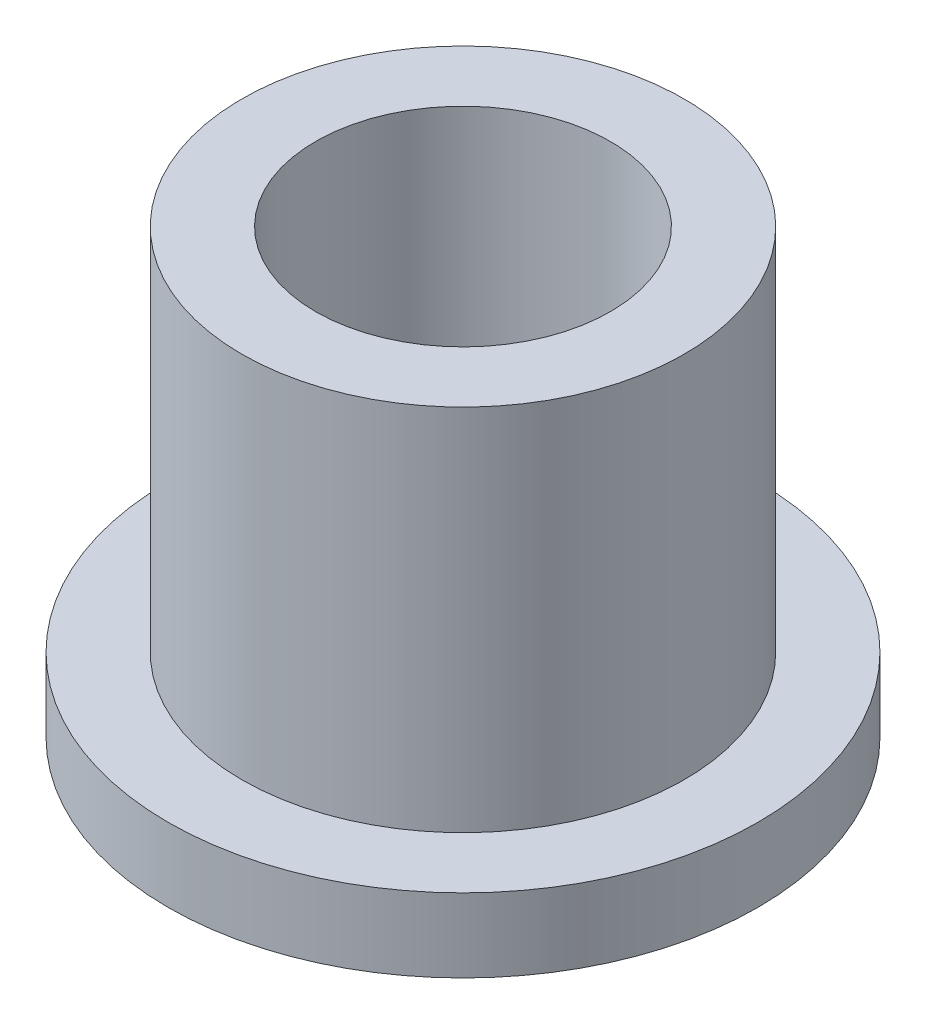
ISO-10303-21;
HEADER;
FILE_DESCRIPTION(('STEP AP214'),'2;1');
FILE_NAME('part.step','',(''),(''),'','','');
FILE_SCHEMA(('AUTOMOTIVE_DESIGN { 1 0 10303 214 1 1 1 1 }'));
ENDSEC;
DATA;
#1=APPLICATION_CONTEXT('core data for automotive mechanical design processes');
#2=APPLICATION_PROTOCOL_DEFINITION('international standard','automotive_design',2000,#1);
#3=PRODUCT_CONTEXT('',#1,'mechanical');
#4=PRODUCT('Part','Part','',(#3));
#5=PRODUCT_RELATED_PRODUCT_CATEGORY('part','',(#4));
#6=PRODUCT_DEFINITION_FORMATION('','',#4);
#7=PRODUCT_DEFINITION_CONTEXT('part definition',#1,'design');
#8=PRODUCT_DEFINITION('design','',#6,#7);
#9=PRODUCT_DEFINITION_SHAPE('','',#8);
#10=(LENGTH_UNIT() NAMED_UNIT(*) SI_UNIT(.MILLI.,.METRE.));
#11=(NAMED_UNIT(*) PLANE_ANGLE_UNIT() SI_UNIT($,.RADIAN.));
#12=(NAMED_UNIT(*) SI_UNIT($,.STERADIAN.) SOLID_ANGLE_UNIT());
#13=UNCERTAINTY_MEASURE_WITH_UNIT(LENGTH_MEASURE(1.E-05),#10,'distance_accuracy_value','');
#14=(GEOMETRIC_REPRESENTATION_CONTEXT(3) GLOBAL_UNCERTAINTY_ASSIGNED_CONTEXT((#13)) GLOBAL_UNIT_ASSIGNED_CONTEXT((#10,
#11,#12)) REPRESENTATION_CONTEXT('',''));
#15=CARTESIAN_POINT('',(0.,0.,0.));
#16=DIRECTION('',(0.,0.,1.));
#17=DIRECTION('',(1.,0.,0.));
#18=AXIS2_PLACEMENT_3D('',#15,#16,#17);
#19=CARTESIAN_POINT('',(0.,9.525,0.));
#20=DIRECTION('',(0.,1.,0.));
#21=DIRECTION('',(0.,0.,1.));
#22=AXIS2_PLACEMENT_3D('',#19,#20,#21);
#23=PLANE('',#22);
#24=CARTESIAN_POINT('',(0.,9.525,0.));
#25=DIRECTION('',(0.,1.,0.));
#26=DIRECTION('',(0.,0.,1.));
#27=AXIS2_PLACEMENT_3D('',#24,#25,#26);
#28=CIRCLE('',#27,4.7625);
#29=CARTESIAN_POINT('',(0.,9.525,4.7625));
#30=VERTEX_POINT('',#29);
#31=EDGE_CURVE('E10',#30,#30,#28,.T.);
#32=ORIENTED_EDGE('',*,*,#31,.T.);
#33=EDGE_LOOP('',(#32));
#34=FACE_BOUND('',#33,.T.);
#35=CARTESIAN_POINT('',(0.,9.525,0.));
#36=DIRECTION('',(0.,1.,0.));
#37=DIRECTION('',(0.,0.,1.));
#38=AXIS2_PLACEMENT_3D('',#35,#36,#37);
#39=CIRCLE('',#38,3.175);
#40=CARTESIAN_POINT('',(0.,9.525,3.175));
#41=VERTEX_POINT('',#40);
#42=EDGE_CURVE('E37',#41,#41,#39,.T.);
#43=ORIENTED_EDGE('',*,*,#42,.F.);
#44=EDGE_LOOP('',(#43));
#45=FACE_BOUND('',#44,.T.);
#46=ADVANCED_FACE('F30',(#34,#45),#23,.T.);
#47=CARTESIAN_POINT('',(0.,0.,0.));
#48=DIRECTION('',(0.,1.,0.));
#49=DIRECTION('',(0.,0.,1.));
#50=AXIS2_PLACEMENT_3D('',#47,#48,#49);
#51=PLANE('',#50);
#52=CARTESIAN_POINT('',(0.,0.,0.));
#53=DIRECTION('',(0.,1.,0.));
#54=DIRECTION('',(0.,0.,1.));
#55=AXIS2_PLACEMENT_3D('',#52,#53,#54);
#56=CIRCLE('',#55,3.175);
#57=CARTESIAN_POINT('',(0.,0.,3.175));
#58=VERTEX_POINT('',#57);
#59=EDGE_CURVE('E41',#58,#58,#56,.T.);
#60=ORIENTED_EDGE('',*,*,#59,.T.);
#61=EDGE_LOOP('',(#60));
#62=FACE_BOUND('',#61,.T.);
#63=CARTESIAN_POINT('',(0.,0.,0.));
#64=DIRECTION('',(0.,1.,0.));
#65=DIRECTION('',(0.,0.,1.));
#66=AXIS2_PLACEMENT_3D('',#63,#64,#65);
#67=CIRCLE('',#66,6.35);
#68=CARTESIAN_POINT('',(0.,0.,6.35));
#69=VERTEX_POINT('',#68);
#70=EDGE_CURVE('E48',#69,#69,#67,.T.);
#71=ORIENTED_EDGE('',*,*,#70,.F.);
#72=EDGE_LOOP('',(#71));
#73=FACE_BOUND('',#72,.T.);
#74=ADVANCED_FACE('F73',(#62,#73),#51,.F.);
#75=CARTESIAN_POINT('',(0.,9.525,0.));
#76=DIRECTION('',(0.,-1.,0.));
#77=DIRECTION('',(0.,0.,-1.));
#78=AXIS2_PLACEMENT_3D('',#75,#76,#77);
#79=CYLINDRICAL_SURFACE('',#78,4.7625);
#80=CARTESIAN_POINT('',(0.,1.5875,0.));
#81=DIRECTION('',(0.,1.,0.));
#82=DIRECTION('',(0.,0.,1.));
#83=AXIS2_PLACEMENT_3D('',#80,#81,#82);
#84=CIRCLE('',#83,4.7625);
#85=CARTESIAN_POINT('',(0.,1.5875,4.7625));
#86=VERTEX_POINT('',#85);
#87=EDGE_CURVE('E51',#86,#86,#84,.T.);
#88=ORIENTED_EDGE('',*,*,#87,.T.);
#89=EDGE_LOOP('',(#88));
#90=FACE_BOUND('',#89,.T.);
#91=ORIENTED_EDGE('',*,*,#31,.F.);
#92=EDGE_LOOP('',(#91));
#93=FACE_BOUND('',#92,.T.);
#94=ADVANCED_FACE('F32',(#90,#93),#79,.T.);
#95=CARTESIAN_POINT('',(0.,9.525,0.));
#96=DIRECTION('',(0.,-1.,0.));
#97=DIRECTION('',(0.,0.,-1.));
#98=AXIS2_PLACEMENT_3D('',#95,#96,#97);
#99=CYLINDRICAL_SURFACE('',#98,3.175);
#100=ORIENTED_EDGE('',*,*,#42,.T.);
#101=EDGE_LOOP('',(#100));
#102=FACE_BOUND('',#101,.T.);
#103=ORIENTED_EDGE('',*,*,#59,.F.);
#104=EDGE_LOOP('',(#103));
#105=FACE_BOUND('',#104,.T.);
#106=ADVANCED_FACE('F62',(#102,#105),#99,.F.);
#107=CARTESIAN_POINT('',(0.,1.5875,0.));
#108=DIRECTION('',(0.,1.,0.));
#109=DIRECTION('',(0.,0.,1.));
#110=AXIS2_PLACEMENT_3D('',#107,#108,#109);
#111=PLANE('',#110);
#112=CARTESIAN_POINT('',(0.,1.5875,0.));
#113=DIRECTION('',(0.,1.,0.));
#114=DIRECTION('',(0.,0.,1.));
#115=AXIS2_PLACEMENT_3D('',#112,#113,#114);
#116=CIRCLE('',#115,6.35);
#117=CARTESIAN_POINT('',(0.,1.5875,6.35));
#118=VERTEX_POINT('',#117);
#119=EDGE_CURVE('E46',#118,#118,#116,.T.);
#120=ORIENTED_EDGE('',*,*,#119,.T.);
#121=EDGE_LOOP('',(#120));
#122=FACE_BOUND('',#121,.T.);
#123=ORIENTED_EDGE('',*,*,#87,.F.);
#124=EDGE_LOOP('',(#123));
#125=FACE_BOUND('',#124,.T.);
#126=ADVANCED_FACE('F59',(#122,#125),#111,.T.);
#127=CARTESIAN_POINT('',(0.,1.5875,0.));
#128=DIRECTION('',(0.,-1.,0.));
#129=DIRECTION('',(0.,0.,-1.));
#130=AXIS2_PLACEMENT_3D('',#127,#128,#129);
#131=CYLINDRICAL_SURFACE('',#130,6.35);
#132=ORIENTED_EDGE('',*,*,#119,.F.);
#133=EDGE_LOOP('',(#132));
#134=FACE_BOUND('',#133,.T.);
#135=ORIENTED_EDGE('',*,*,#70,.T.);
#136=EDGE_LOOP('',(#135));
#137=FACE_BOUND('',#136,.T.);
#138=ADVANCED_FACE('F61',(#134,#137),#131,.T.);
#139=CLOSED_SHELL('',(#46,#74,#94,#106,#126,#138));
#140=MANIFOLD_SOLID_BREP('B2',#139);
#141=ADVANCED_BREP_SHAPE_REPRESENTATION('',(#18,#140),#14);
#142=SHAPE_DEFINITION_REPRESENTATION(#9,#141);
ENDSEC;
END-ISO-10303-21;
